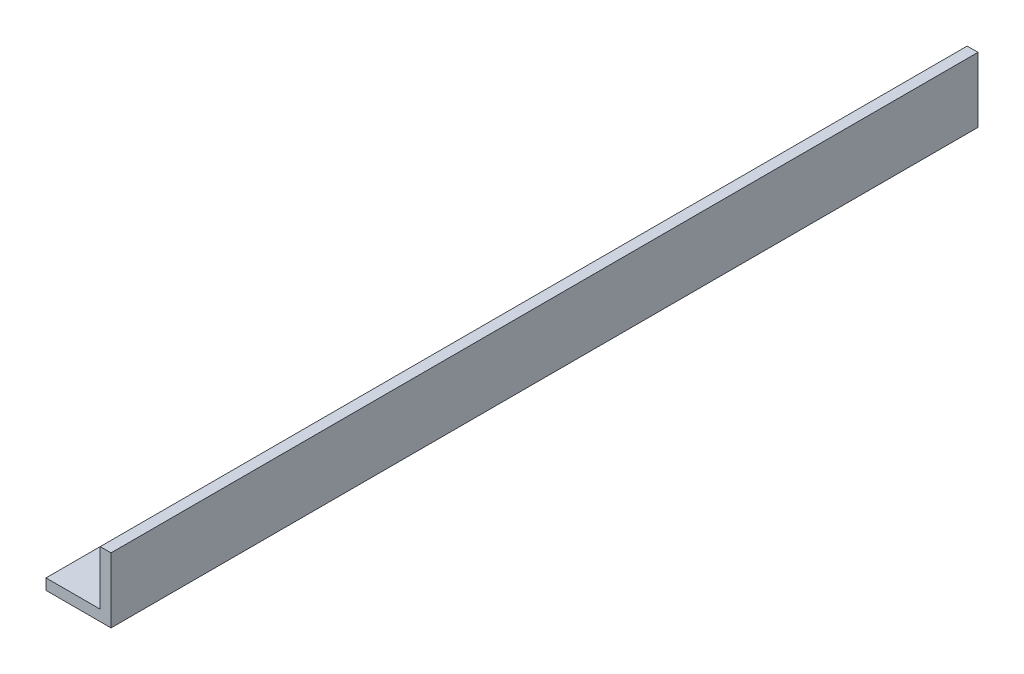
ISO-10303-21;
HEADER;
FILE_DESCRIPTION(('STEP AP214'),'2;1');
FILE_NAME('part.step','',(''),(''),'','','');
FILE_SCHEMA(('AUTOMOTIVE_DESIGN { 1 0 10303 214 1 1 1 1 }'));
ENDSEC;
DATA;
#1=APPLICATION_CONTEXT('core data for automotive mechanical design processes');
#2=APPLICATION_PROTOCOL_DEFINITION('international standard','automotive_design',2000,#1);
#3=PRODUCT_CONTEXT('',#1,'mechanical');
#4=PRODUCT('Part','Part','',(#3));
#5=PRODUCT_RELATED_PRODUCT_CATEGORY('part','',(#4));
#6=PRODUCT_DEFINITION_FORMATION('','',#4);
#7=PRODUCT_DEFINITION_CONTEXT('part definition',#1,'design');
#8=PRODUCT_DEFINITION('design','',#6,#7);
#9=PRODUCT_DEFINITION_SHAPE('','',#8);
#10=(LENGTH_UNIT() NAMED_UNIT(*) SI_UNIT(.MILLI.,.METRE.));
#11=(NAMED_UNIT(*) PLANE_ANGLE_UNIT() SI_UNIT($,.RADIAN.));
#12=(NAMED_UNIT(*) SI_UNIT($,.STERADIAN.) SOLID_ANGLE_UNIT());
#13=UNCERTAINTY_MEASURE_WITH_UNIT(LENGTH_MEASURE(1.E-05),#10,'distance_accuracy_value','');
#14=(GEOMETRIC_REPRESENTATION_CONTEXT(3) GLOBAL_UNCERTAINTY_ASSIGNED_CONTEXT((#13)) GLOBAL_UNIT_ASSIGNED_CONTEXT((#10,
#11,#12)) REPRESENTATION_CONTEXT('',''));
#15=CARTESIAN_POINT('',(0.,0.,0.));
#16=DIRECTION('',(0.,0.,1.));
#17=DIRECTION('',(1.,0.,0.));
#18=AXIS2_PLACEMENT_3D('',#15,#16,#17);
#19=CARTESIAN_POINT('',(3.175,4.7625,63.5));
#20=DIRECTION('',(1.,0.,0.));
#21=DIRECTION('',(0.,1.,0.));
#22=AXIS2_PLACEMENT_3D('',#19,#20,#21);
#23=PLANE('',#22);
#24=DIRECTION('',(0.,-1.,0.));
#25=VECTOR('',#24,1.);
#26=CARTESIAN_POINT('',(3.175,4.7625,-63.5));
#27=LINE('',#26,#25);
#28=CARTESIAN_POINT('',(3.175,4.7625,-63.5));
#29=VERTEX_POINT('',#28);
#30=CARTESIAN_POINT('',(3.175,-3.175,-63.5));
#31=VERTEX_POINT('',#30);
#32=EDGE_CURVE('E121',#29,#31,#27,.T.);
#33=ORIENTED_EDGE('',*,*,#32,.T.);
#34=DIRECTION('',(0.,0.,-1.));
#35=VECTOR('',#34,1.);
#36=CARTESIAN_POINT('',(3.175,-3.175,63.5));
#37=LINE('',#36,#35);
#38=CARTESIAN_POINT('',(3.175,-3.175,63.5));
#39=VERTEX_POINT('',#38);
#40=EDGE_CURVE('E11',#39,#31,#37,.T.);
#41=ORIENTED_EDGE('',*,*,#40,.F.);
#42=DIRECTION('',(0.,-1.,0.));
#43=VECTOR('',#42,1.);
#44=CARTESIAN_POINT('',(3.175,4.7625,63.5));
#45=LINE('',#44,#43);
#46=CARTESIAN_POINT('',(3.175,4.7625,63.5));
#47=VERTEX_POINT('',#46);
#48=EDGE_CURVE('E131',#47,#39,#45,.T.);
#49=ORIENTED_EDGE('',*,*,#48,.F.);
#50=DIRECTION('',(0.,0.,-1.));
#51=VECTOR('',#50,1.);
#52=CARTESIAN_POINT('',(3.175,4.7625,63.5));
#53=LINE('',#52,#51);
#54=EDGE_CURVE('E117',#47,#29,#53,.T.);
#55=ORIENTED_EDGE('',*,*,#54,.T.);
#56=EDGE_LOOP('',(#33,#41,#49,#55));
#57=FACE_BOUND('',#56,.T.);
#58=ADVANCED_FACE('F37',(#57),#23,.F.);
#59=CARTESIAN_POINT('',(3.175,-3.175,63.5));
#60=DIRECTION('',(0.,-1.,0.));
#61=DIRECTION('',(1.,0.,0.));
#62=AXIS2_PLACEMENT_3D('',#59,#60,#61);
#63=PLANE('',#62);
#64=DIRECTION('',(-1.,0.,0.));
#65=VECTOR('',#64,1.);
#66=CARTESIAN_POINT('',(3.175,-3.175,-63.5));
#67=LINE('',#66,#65);
#68=CARTESIAN_POINT('',(-4.7625,-3.175,-63.5));
#69=VERTEX_POINT('',#68);
#70=EDGE_CURVE('E124',#31,#69,#67,.T.);
#71=ORIENTED_EDGE('',*,*,#70,.T.);
#72=DIRECTION('',(0.,0.,-1.));
#73=VECTOR('',#72,1.);
#74=CARTESIAN_POINT('',(-4.7625,-3.175,63.5));
#75=LINE('',#74,#73);
#76=CARTESIAN_POINT('',(-4.7625,-3.175,63.5));
#77=VERTEX_POINT('',#76);
#78=EDGE_CURVE('E45',#77,#69,#75,.T.);
#79=ORIENTED_EDGE('',*,*,#78,.F.);
#80=DIRECTION('',(-1.,0.,0.));
#81=VECTOR('',#80,1.);
#82=CARTESIAN_POINT('',(3.175,-3.175,63.5));
#83=LINE('',#82,#81);
#84=EDGE_CURVE('E90',#39,#77,#83,.T.);
#85=ORIENTED_EDGE('',*,*,#84,.F.);
#86=ORIENTED_EDGE('',*,*,#40,.T.);
#87=EDGE_LOOP('',(#71,#79,#85,#86));
#88=FACE_BOUND('',#87,.T.);
#89=ADVANCED_FACE('F155',(#88),#63,.F.);
#90=CARTESIAN_POINT('',(-4.7625,-4.7625,63.5));
#91=DIRECTION('',(1.,0.,0.));
#92=DIRECTION('',(0.,0.,-1.));
#93=AXIS2_PLACEMENT_3D('',#90,#91,#92);
#94=PLANE('',#93);
#95=DIRECTION('',(0.,-1.,0.));
#96=VECTOR('',#95,1.);
#97=CARTESIAN_POINT('',(-4.7625,-4.7625,-63.5));
#98=LINE('',#97,#96);
#99=CARTESIAN_POINT('',(-4.7625,-4.7625,-63.5));
#100=VERTEX_POINT('',#99);
#101=EDGE_CURVE('E126',#69,#100,#98,.T.);
#102=ORIENTED_EDGE('',*,*,#101,.T.);
#103=DIRECTION('',(0.,0.,-1.));
#104=VECTOR('',#103,1.);
#105=CARTESIAN_POINT('',(-4.7625,-4.7625,63.5));
#106=LINE('',#105,#104);
#107=CARTESIAN_POINT('',(-4.7625,-4.7625,63.5));
#108=VERTEX_POINT('',#107);
#109=EDGE_CURVE('E112',#108,#100,#106,.T.);
#110=ORIENTED_EDGE('',*,*,#109,.F.);
#111=DIRECTION('',(0.,-1.,0.));
#112=VECTOR('',#111,1.);
#113=CARTESIAN_POINT('',(-4.7625,-4.7625,63.5));
#114=LINE('',#113,#112);
#115=EDGE_CURVE('E103',#77,#108,#114,.T.);
#116=ORIENTED_EDGE('',*,*,#115,.F.);
#117=ORIENTED_EDGE('',*,*,#78,.T.);
#118=EDGE_LOOP('',(#102,#110,#116,#117));
#119=FACE_BOUND('',#118,.T.);
#120=ADVANCED_FACE('F137',(#119),#94,.F.);
#121=CARTESIAN_POINT('',(-4.7625,-4.7625,63.5));
#122=DIRECTION('',(0.,1.,0.));
#123=DIRECTION('',(0.,0.,1.));
#124=AXIS2_PLACEMENT_3D('',#121,#122,#123);
#125=PLANE('',#124);
#126=DIRECTION('',(1.,0.,0.));
#127=VECTOR('',#126,1.);
#128=CARTESIAN_POINT('',(-4.7625,-4.7625,-63.5));
#129=LINE('',#128,#127);
#130=CARTESIAN_POINT('',(4.7625,-4.7625,-63.5));
#131=VERTEX_POINT('',#130);
#132=EDGE_CURVE('E111',#100,#131,#129,.T.);
#133=ORIENTED_EDGE('',*,*,#132,.T.);
#134=DIRECTION('',(0.,0.,-1.));
#135=VECTOR('',#134,1.);
#136=CARTESIAN_POINT('',(4.7625,-4.7625,63.5));
#137=LINE('',#136,#135);
#138=CARTESIAN_POINT('',(4.7625,-4.7625,63.5));
#139=VERTEX_POINT('',#138);
#140=EDGE_CURVE('E108',#139,#131,#137,.T.);
#141=ORIENTED_EDGE('',*,*,#140,.F.);
#142=DIRECTION('',(1.,0.,0.));
#143=VECTOR('',#142,1.);
#144=CARTESIAN_POINT('',(-4.7625,-4.7625,63.5));
#145=LINE('',#144,#143);
#146=EDGE_CURVE('E97',#108,#139,#145,.T.);
#147=ORIENTED_EDGE('',*,*,#146,.F.);
#148=ORIENTED_EDGE('',*,*,#109,.T.);
#149=EDGE_LOOP('',(#133,#141,#147,#148));
#150=FACE_BOUND('',#149,.T.);
#151=ADVANCED_FACE('F109',(#150),#125,.F.);
#152=CARTESIAN_POINT('',(4.7625,-4.7625,63.5));
#153=DIRECTION('',(-1.,0.,0.));
#154=DIRECTION('',(0.,0.,1.));
#155=AXIS2_PLACEMENT_3D('',#152,#153,#154);
#156=PLANE('',#155);
#157=DIRECTION('',(0.,1.,0.));
#158=VECTOR('',#157,1.);
#159=CARTESIAN_POINT('',(4.7625,-4.7625,-63.5));
#160=LINE('',#159,#158);
#161=CARTESIAN_POINT('',(4.7625,4.7625,-63.5));
#162=VERTEX_POINT('',#161);
#163=EDGE_CURVE('E76',#131,#162,#160,.T.);
#164=ORIENTED_EDGE('',*,*,#163,.T.);
#165=DIRECTION('',(0.,0.,-1.));
#166=VECTOR('',#165,1.);
#167=CARTESIAN_POINT('',(4.7625,4.7625,63.5));
#168=LINE('',#167,#166);
#169=CARTESIAN_POINT('',(4.7625,4.7625,63.5));
#170=VERTEX_POINT('',#169);
#171=EDGE_CURVE('E113',#170,#162,#168,.T.);
#172=ORIENTED_EDGE('',*,*,#171,.F.);
#173=DIRECTION('',(0.,1.,0.));
#174=VECTOR('',#173,1.);
#175=CARTESIAN_POINT('',(4.7625,-4.7625,63.5));
#176=LINE('',#175,#174);
#177=EDGE_CURVE('E101',#139,#170,#176,.T.);
#178=ORIENTED_EDGE('',*,*,#177,.F.);
#179=ORIENTED_EDGE('',*,*,#140,.T.);
#180=EDGE_LOOP('',(#164,#172,#178,#179));
#181=FACE_BOUND('',#180,.T.);
#182=ADVANCED_FACE('F115',(#181),#156,.F.);
#183=CARTESIAN_POINT('',(4.7625,4.7625,63.5));
#184=DIRECTION('',(0.,-1.,0.));
#185=DIRECTION('',(1.,0.,0.));
#186=AXIS2_PLACEMENT_3D('',#183,#184,#185);
#187=PLANE('',#186);
#188=DIRECTION('',(-1.,0.,0.));
#189=VECTOR('',#188,1.);
#190=CARTESIAN_POINT('',(4.7625,4.7625,-63.5));
#191=LINE('',#190,#189);
#192=EDGE_CURVE('E82',#162,#29,#191,.T.);
#193=ORIENTED_EDGE('',*,*,#192,.T.);
#194=ORIENTED_EDGE('',*,*,#54,.F.);
#195=DIRECTION('',(-1.,0.,0.));
#196=VECTOR('',#195,1.);
#197=CARTESIAN_POINT('',(4.7625,4.7625,63.5));
#198=LINE('',#197,#196);
#199=EDGE_CURVE('E53',#170,#47,#198,.T.);
#200=ORIENTED_EDGE('',*,*,#199,.F.);
#201=ORIENTED_EDGE('',*,*,#171,.T.);
#202=EDGE_LOOP('',(#193,#194,#200,#201));
#203=FACE_BOUND('',#202,.T.);
#204=ADVANCED_FACE('F144',(#203),#187,.F.);
#205=CARTESIAN_POINT('',(0.,0.,63.5));
#206=DIRECTION('',(0.,0.,-1.));
#207=DIRECTION('',(-1.,0.,0.));
#208=AXIS2_PLACEMENT_3D('',#205,#206,#207);
#209=PLANE('',#208);
#210=ORIENTED_EDGE('',*,*,#48,.T.);
#211=ORIENTED_EDGE('',*,*,#84,.T.);
#212=ORIENTED_EDGE('',*,*,#115,.T.);
#213=ORIENTED_EDGE('',*,*,#146,.T.);
#214=ORIENTED_EDGE('',*,*,#177,.T.);
#215=ORIENTED_EDGE('',*,*,#199,.T.);
#216=EDGE_LOOP('',(#210,#211,#212,#213,#214,#215));
#217=FACE_BOUND('',#216,.T.);
#218=ADVANCED_FACE('F99',(#217),#209,.F.);
#219=CARTESIAN_POINT('',(0.,0.,-63.5));
#220=DIRECTION('',(0.,0.,-1.));
#221=DIRECTION('',(-1.,0.,0.));
#222=AXIS2_PLACEMENT_3D('',#219,#220,#221);
#223=PLANE('',#222);
#224=ORIENTED_EDGE('',*,*,#32,.F.);
#225=ORIENTED_EDGE('',*,*,#192,.F.);
#226=ORIENTED_EDGE('',*,*,#163,.F.);
#227=ORIENTED_EDGE('',*,*,#132,.F.);
#228=ORIENTED_EDGE('',*,*,#101,.F.);
#229=ORIENTED_EDGE('',*,*,#70,.F.);
#230=EDGE_LOOP('',(#224,#225,#226,#227,#228,#229));
#231=FACE_BOUND('',#230,.T.);
#232=ADVANCED_FACE('F140',(#231),#223,.T.);
#233=CLOSED_SHELL('',(#58,#89,#120,#151,#182,#204,#218,#232));
#234=MANIFOLD_SOLID_BREP('B2',#233);
#235=ADVANCED_BREP_SHAPE_REPRESENTATION('',(#18,#234),#14);
#236=SHAPE_DEFINITION_REPRESENTATION(#9,#235);
ENDSEC;
END-ISO-10303-21;
